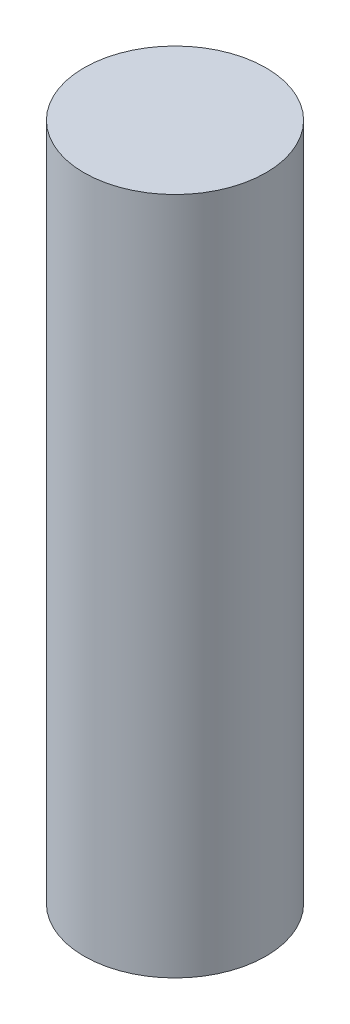
ISO-10303-21;
HEADER;
FILE_DESCRIPTION(('STEP AP214'),'2;1');
FILE_NAME('part.step','',(''),(''),'','','');
FILE_SCHEMA(('AUTOMOTIVE_DESIGN { 1 0 10303 214 1 1 1 1 }'));
ENDSEC;
DATA;
#1=APPLICATION_CONTEXT('core data for automotive mechanical design processes');
#2=APPLICATION_PROTOCOL_DEFINITION('international standard','automotive_design',2000,#1);
#3=PRODUCT_CONTEXT('',#1,'mechanical');
#4=PRODUCT('Part','Part','',(#3));
#5=PRODUCT_RELATED_PRODUCT_CATEGORY('part','',(#4));
#6=PRODUCT_DEFINITION_FORMATION('','',#4);
#7=PRODUCT_DEFINITION_CONTEXT('part definition',#1,'design');
#8=PRODUCT_DEFINITION('design','',#6,#7);
#9=PRODUCT_DEFINITION_SHAPE('','',#8);
#10=(LENGTH_UNIT() NAMED_UNIT(*) SI_UNIT(.MILLI.,.METRE.));
#11=(NAMED_UNIT(*) PLANE_ANGLE_UNIT() SI_UNIT($,.RADIAN.));
#12=(NAMED_UNIT(*) SI_UNIT($,.STERADIAN.) SOLID_ANGLE_UNIT());
#13=UNCERTAINTY_MEASURE_WITH_UNIT(LENGTH_MEASURE(1.E-05),#10,'distance_accuracy_value','');
#14=(GEOMETRIC_REPRESENTATION_CONTEXT(3) GLOBAL_UNCERTAINTY_ASSIGNED_CONTEXT((#13)) GLOBAL_UNIT_ASSIGNED_CONTEXT((#10,
#11,#12)) REPRESENTATION_CONTEXT('',''));
#15=CARTESIAN_POINT('',(0.,0.,0.));
#16=DIRECTION('',(0.,0.,1.));
#17=DIRECTION('',(1.,0.,0.));
#18=AXIS2_PLACEMENT_3D('',#15,#16,#17);
#19=CARTESIAN_POINT('',(0.,68.7,0.));
#20=DIRECTION('',(0.,-1.,0.));
#21=DIRECTION('',(0.,0.,-1.));
#22=AXIS2_PLACEMENT_3D('',#19,#20,#21);
#23=CYLINDRICAL_SURFACE('',#22,9.21);
#24=CARTESIAN_POINT('',(0.,68.7,0.));
#25=DIRECTION('',(0.,1.,0.));
#26=DIRECTION('',(0.,0.,1.));
#27=AXIS2_PLACEMENT_3D('',#24,#25,#26);
#28=CIRCLE('',#27,9.21);
#29=CARTESIAN_POINT('',(0.,68.7,9.21));
#30=VERTEX_POINT('',#29);
#31=EDGE_CURVE('E10',#30,#30,#28,.T.);
#32=ORIENTED_EDGE('',*,*,#31,.F.);
#33=EDGE_LOOP('',(#32));
#34=FACE_BOUND('',#33,.T.);
#35=CARTESIAN_POINT('',(0.,0.,0.));
#36=DIRECTION('',(0.,1.,0.));
#37=DIRECTION('',(0.,0.,1.));
#38=AXIS2_PLACEMENT_3D('',#35,#36,#37);
#39=CIRCLE('',#38,9.21);
#40=CARTESIAN_POINT('',(0.,0.,9.21));
#41=VERTEX_POINT('',#40);
#42=EDGE_CURVE('E42',#41,#41,#39,.T.);
#43=ORIENTED_EDGE('',*,*,#42,.T.);
#44=EDGE_LOOP('',(#43));
#45=FACE_BOUND('',#44,.T.);
#46=ADVANCED_FACE('F39',(#34,#45),#23,.T.);
#47=CARTESIAN_POINT('',(0.,68.7,0.));
#48=DIRECTION('',(0.,1.,0.));
#49=DIRECTION('',(0.,0.,1.));
#50=AXIS2_PLACEMENT_3D('',#47,#48,#49);
#51=PLANE('',#50);
#52=ORIENTED_EDGE('',*,*,#31,.T.);
#53=EDGE_LOOP('',(#52));
#54=FACE_BOUND('',#53,.T.);
#55=ADVANCED_FACE('F56',(#54),#51,.T.);
#56=CARTESIAN_POINT('',(0.,0.,0.));
#57=DIRECTION('',(0.,1.,0.));
#58=DIRECTION('',(0.,0.,1.));
#59=AXIS2_PLACEMENT_3D('',#56,#57,#58);
#60=PLANE('',#59);
#61=ORIENTED_EDGE('',*,*,#42,.F.);
#62=EDGE_LOOP('',(#61));
#63=FACE_BOUND('',#62,.T.);
#64=ADVANCED_FACE('F54',(#63),#60,.F.);
#65=CLOSED_SHELL('',(#46,#55,#64));
#66=MANIFOLD_SOLID_BREP('B2',#65);
#67=ADVANCED_BREP_SHAPE_REPRESENTATION('',(#18,#66),#14);
#68=SHAPE_DEFINITION_REPRESENTATION(#9,#67);
ENDSEC;
END-ISO-10303-21;
